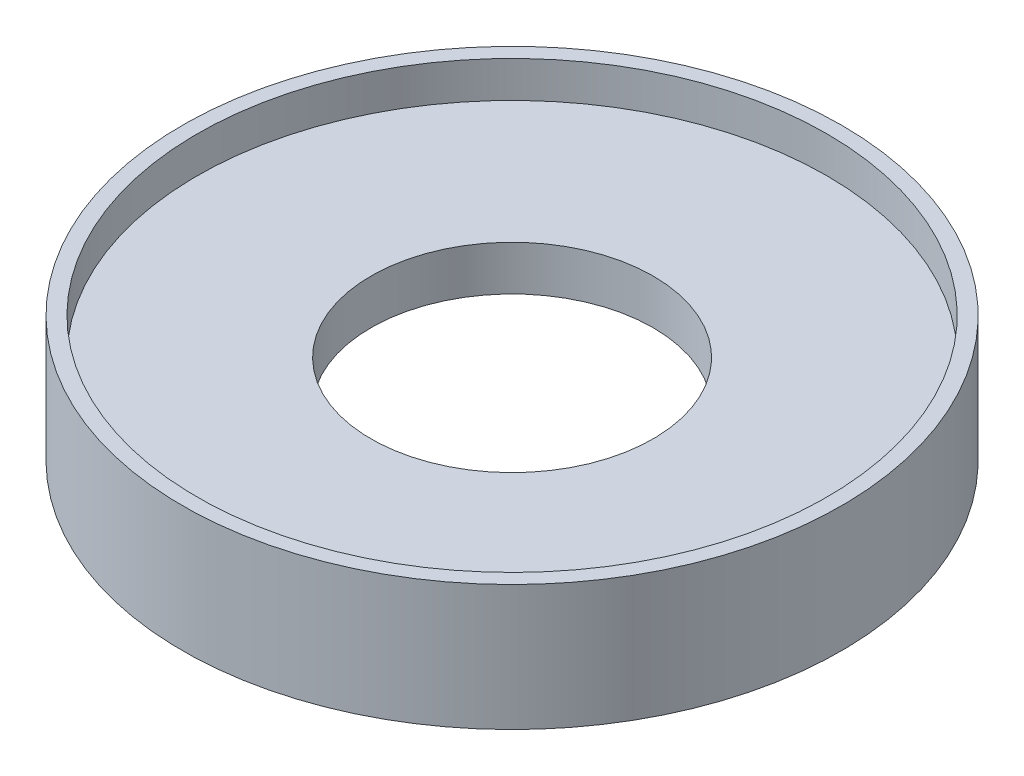
ISO-10303-21;
HEADER;
FILE_DESCRIPTION(('STEP AP214'),'2;1');
FILE_NAME('part.step','',(''),(''),'','','');
FILE_SCHEMA(('AUTOMOTIVE_DESIGN { 1 0 10303 214 1 1 1 1 }'));
ENDSEC;
DATA;
#1=APPLICATION_CONTEXT('core data for automotive mechanical design processes');
#2=APPLICATION_PROTOCOL_DEFINITION('international standard','automotive_design',2000,#1);
#3=PRODUCT_CONTEXT('',#1,'mechanical');
#4=PRODUCT('Part','Part','',(#3));
#5=PRODUCT_RELATED_PRODUCT_CATEGORY('part','',(#4));
#6=PRODUCT_DEFINITION_FORMATION('','',#4);
#7=PRODUCT_DEFINITION_CONTEXT('part definition',#1,'design');
#8=PRODUCT_DEFINITION('design','',#6,#7);
#9=PRODUCT_DEFINITION_SHAPE('','',#8);
#10=(LENGTH_UNIT() NAMED_UNIT(*) SI_UNIT(.MILLI.,.METRE.));
#11=(NAMED_UNIT(*) PLANE_ANGLE_UNIT() SI_UNIT($,.RADIAN.));
#12=(NAMED_UNIT(*) SI_UNIT($,.STERADIAN.) SOLID_ANGLE_UNIT());
#13=UNCERTAINTY_MEASURE_WITH_UNIT(LENGTH_MEASURE(1.E-05),#10,'distance_accuracy_value','');
#14=(GEOMETRIC_REPRESENTATION_CONTEXT(3) GLOBAL_UNCERTAINTY_ASSIGNED_CONTEXT((#13)) GLOBAL_UNIT_ASSIGNED_CONTEXT((#10,
#11,#12)) REPRESENTATION_CONTEXT('',''));
#15=CARTESIAN_POINT('',(0.,0.,0.));
#16=DIRECTION('',(0.,0.,1.));
#17=DIRECTION('',(1.,0.,0.));
#18=AXIS2_PLACEMENT_3D('',#15,#16,#17);
#19=CARTESIAN_POINT('',(0.,0.,0.));
#20=DIRECTION('',(0.,-1.,0.));
#21=DIRECTION('',(0.,0.,-1.));
#22=AXIS2_PLACEMENT_3D('',#19,#20,#21);
#23=CYLINDRICAL_SURFACE('',#22,19.05);
#24=CARTESIAN_POINT('',(0.,0.,0.));
#25=DIRECTION('',(0.,-1.,0.));
#26=DIRECTION('',(0.,0.,-1.));
#27=AXIS2_PLACEMENT_3D('',#24,#25,#26);
#28=CIRCLE('',#27,19.05);
#29=CARTESIAN_POINT('',(0.,0.,-19.05));
#30=VERTEX_POINT('',#29);
#31=EDGE_CURVE('E10',#30,#30,#28,.T.);
#32=ORIENTED_EDGE('',*,*,#31,.T.);
#33=EDGE_LOOP('',(#32));
#34=FACE_BOUND('',#33,.T.);
#35=CARTESIAN_POINT('',(0.,6.05,0.));
#36=DIRECTION('',(0.,-1.,0.));
#37=DIRECTION('',(0.,0.,-1.));
#38=AXIS2_PLACEMENT_3D('',#35,#36,#37);
#39=CIRCLE('',#38,19.05);
#40=CARTESIAN_POINT('',(0.,6.05,-19.05));
#41=VERTEX_POINT('',#40);
#42=EDGE_CURVE('E63',#41,#41,#39,.T.);
#43=ORIENTED_EDGE('',*,*,#42,.F.);
#44=EDGE_LOOP('',(#43));
#45=FACE_BOUND('',#44,.T.);
#46=ADVANCED_FACE('F35',(#34,#45),#23,.F.);
#47=CARTESIAN_POINT('',(0.,0.,-19.05));
#48=DIRECTION('',(0.,-1.,0.));
#49=DIRECTION('',(0.,0.,-1.));
#50=AXIS2_PLACEMENT_3D('',#47,#48,#49);
#51=PLANE('',#50);
#52=CARTESIAN_POINT('',(0.,0.,0.));
#53=DIRECTION('',(0.,-1.,0.));
#54=DIRECTION('',(0.,0.,-1.));
#55=AXIS2_PLACEMENT_3D('',#52,#53,#54);
#56=CIRCLE('',#55,42.5);
#57=CARTESIAN_POINT('',(0.,0.,-42.5));
#58=VERTEX_POINT('',#57);
#59=EDGE_CURVE('E41',#58,#58,#56,.T.);
#60=ORIENTED_EDGE('',*,*,#59,.T.);
#61=EDGE_LOOP('',(#60));
#62=FACE_BOUND('',#61,.T.);
#63=ORIENTED_EDGE('',*,*,#31,.F.);
#64=EDGE_LOOP('',(#63));
#65=FACE_BOUND('',#64,.T.);
#66=ADVANCED_FACE('F71',(#62,#65),#51,.T.);
#67=CARTESIAN_POINT('',(0.,0.,0.));
#68=DIRECTION('',(0.,-1.,0.));
#69=DIRECTION('',(0.,0.,-1.));
#70=AXIS2_PLACEMENT_3D('',#67,#68,#69);
#71=CYLINDRICAL_SURFACE('',#70,42.5);
#72=CARTESIAN_POINT('',(0.,-6.,0.));
#73=DIRECTION('',(0.,-1.,0.));
#74=DIRECTION('',(0.,0.,-1.));
#75=AXIS2_PLACEMENT_3D('',#72,#73,#74);
#76=CIRCLE('',#75,42.5);
#77=CARTESIAN_POINT('',(0.,-6.,-42.5));
#78=VERTEX_POINT('',#77);
#79=EDGE_CURVE('E45',#78,#78,#76,.T.);
#80=ORIENTED_EDGE('',*,*,#79,.T.);
#81=EDGE_LOOP('',(#80));
#82=FACE_BOUND('',#81,.T.);
#83=ORIENTED_EDGE('',*,*,#59,.F.);
#84=EDGE_LOOP('',(#83));
#85=FACE_BOUND('',#84,.T.);
#86=ADVANCED_FACE('F75',(#82,#85),#71,.F.);
#87=CARTESIAN_POINT('',(0.,-6.,-42.5));
#88=DIRECTION('',(0.,-1.,0.));
#89=DIRECTION('',(0.,0.,-1.));
#90=AXIS2_PLACEMENT_3D('',#87,#88,#89);
#91=PLANE('',#90);
#92=CARTESIAN_POINT('',(0.,-6.,0.));
#93=DIRECTION('',(0.,-1.,0.));
#94=DIRECTION('',(0.,0.,-1.));
#95=AXIS2_PLACEMENT_3D('',#92,#93,#94);
#96=CIRCLE('',#95,44.5);
#97=CARTESIAN_POINT('',(0.,-6.,-44.5));
#98=VERTEX_POINT('',#97);
#99=EDGE_CURVE('E49',#98,#98,#96,.T.);
#100=ORIENTED_EDGE('',*,*,#99,.T.);
#101=EDGE_LOOP('',(#100));
#102=FACE_BOUND('',#101,.T.);
#103=ORIENTED_EDGE('',*,*,#79,.F.);
#104=EDGE_LOOP('',(#103));
#105=FACE_BOUND('',#104,.T.);
#106=ADVANCED_FACE('F79',(#102,#105),#91,.T.);
#107=CARTESIAN_POINT('',(0.,0.,0.));
#108=DIRECTION('',(0.,-1.,0.));
#109=DIRECTION('',(0.,0.,-1.));
#110=AXIS2_PLACEMENT_3D('',#107,#108,#109);
#111=CYLINDRICAL_SURFACE('',#110,44.5);
#112=CARTESIAN_POINT('',(0.,10.96,0.));
#113=DIRECTION('',(0.,-1.,0.));
#114=DIRECTION('',(0.,0.,-1.));
#115=AXIS2_PLACEMENT_3D('',#112,#113,#114);
#116=CIRCLE('',#115,44.5);
#117=CARTESIAN_POINT('',(0.,10.96,-44.5));
#118=VERTEX_POINT('',#117);
#119=EDGE_CURVE('E54',#118,#118,#116,.T.);
#120=ORIENTED_EDGE('',*,*,#119,.T.);
#121=EDGE_LOOP('',(#120));
#122=FACE_BOUND('',#121,.T.);
#123=ORIENTED_EDGE('',*,*,#99,.F.);
#124=EDGE_LOOP('',(#123));
#125=FACE_BOUND('',#124,.T.);
#126=ADVANCED_FACE('F86',(#122,#125),#111,.T.);
#127=CARTESIAN_POINT('',(0.,10.96,-44.5));
#128=DIRECTION('',(0.,1.,0.));
#129=DIRECTION('',(0.,0.,1.));
#130=AXIS2_PLACEMENT_3D('',#127,#128,#129);
#131=PLANE('',#130);
#132=CARTESIAN_POINT('',(0.,10.96,0.));
#133=DIRECTION('',(0.,-1.,0.));
#134=DIRECTION('',(0.,0.,-1.));
#135=AXIS2_PLACEMENT_3D('',#132,#133,#134);
#136=CIRCLE('',#135,42.5);
#137=CARTESIAN_POINT('',(0.,10.96,-42.5));
#138=VERTEX_POINT('',#137);
#139=EDGE_CURVE('E57',#138,#138,#136,.T.);
#140=ORIENTED_EDGE('',*,*,#139,.T.);
#141=EDGE_LOOP('',(#140));
#142=FACE_BOUND('',#141,.T.);
#143=ORIENTED_EDGE('',*,*,#119,.F.);
#144=EDGE_LOOP('',(#143));
#145=FACE_BOUND('',#144,.T.);
#146=ADVANCED_FACE('F90',(#142,#145),#131,.T.);
#147=CARTESIAN_POINT('',(0.,0.,0.));
#148=DIRECTION('',(0.,-1.,0.));
#149=DIRECTION('',(0.,0.,-1.));
#150=AXIS2_PLACEMENT_3D('',#147,#148,#149);
#151=CYLINDRICAL_SURFACE('',#150,42.5);
#152=CARTESIAN_POINT('',(0.,6.05,0.));
#153=DIRECTION('',(0.,-1.,0.));
#154=DIRECTION('',(0.,0.,-1.));
#155=AXIS2_PLACEMENT_3D('',#152,#153,#154);
#156=CIRCLE('',#155,42.5);
#157=CARTESIAN_POINT('',(0.,6.05,-42.5));
#158=VERTEX_POINT('',#157);
#159=EDGE_CURVE('E60',#158,#158,#156,.T.);
#160=ORIENTED_EDGE('',*,*,#159,.T.);
#161=EDGE_LOOP('',(#160));
#162=FACE_BOUND('',#161,.T.);
#163=ORIENTED_EDGE('',*,*,#139,.F.);
#164=EDGE_LOOP('',(#163));
#165=FACE_BOUND('',#164,.T.);
#166=ADVANCED_FACE('F94',(#162,#165),#151,.F.);
#167=CARTESIAN_POINT('',(0.,6.05,-42.5));
#168=DIRECTION('',(0.,1.,0.));
#169=DIRECTION('',(0.,0.,1.));
#170=AXIS2_PLACEMENT_3D('',#167,#168,#169);
#171=PLANE('',#170);
#172=ORIENTED_EDGE('',*,*,#42,.T.);
#173=EDGE_LOOP('',(#172));
#174=FACE_BOUND('',#173,.T.);
#175=ORIENTED_EDGE('',*,*,#159,.F.);
#176=EDGE_LOOP('',(#175));
#177=FACE_BOUND('',#176,.T.);
#178=ADVANCED_FACE('F67',(#174,#177),#171,.T.);
#179=CLOSED_SHELL('',(#46,#66,#86,#106,#126,#146,#166,#178));
#180=MANIFOLD_SOLID_BREP('B2',#179);
#181=ADVANCED_BREP_SHAPE_REPRESENTATION('',(#18,#180),#14);
#182=SHAPE_DEFINITION_REPRESENTATION(#9,#181);
ENDSEC;
END-ISO-10303-21;
